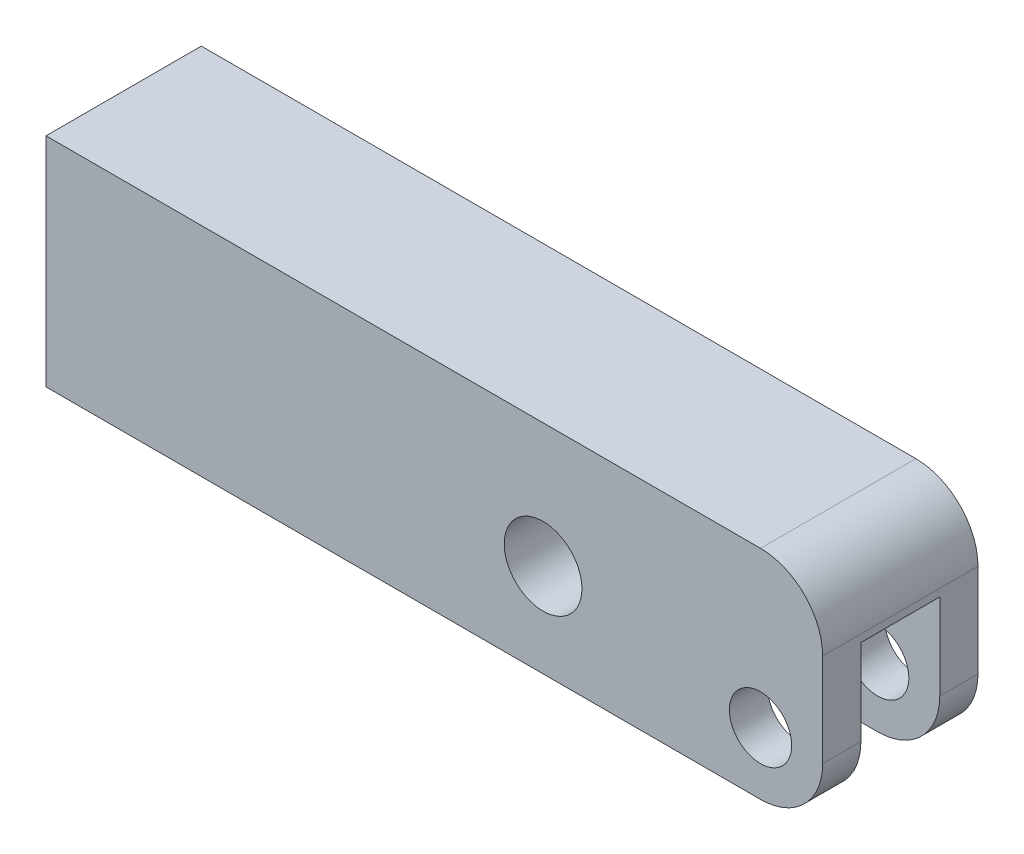
ISO-10303-21;
HEADER;
FILE_DESCRIPTION(('STEP AP214'),'2;1');
FILE_NAME('part.step','',(''),(''),'','','');
FILE_SCHEMA(('AUTOMOTIVE_DESIGN { 1 0 10303 214 1 1 1 1 }'));
ENDSEC;
DATA;
#1=APPLICATION_CONTEXT('core data for automotive mechanical design processes');
#2=APPLICATION_PROTOCOL_DEFINITION('international standard','automotive_design',2000,#1);
#3=PRODUCT_CONTEXT('',#1,'mechanical');
#4=PRODUCT('Part','Part','',(#3));
#5=PRODUCT_RELATED_PRODUCT_CATEGORY('part','',(#4));
#6=PRODUCT_DEFINITION_FORMATION('','',#4);
#7=PRODUCT_DEFINITION_CONTEXT('part definition',#1,'design');
#8=PRODUCT_DEFINITION('design','',#6,#7);
#9=PRODUCT_DEFINITION_SHAPE('','',#8);
#10=(LENGTH_UNIT() NAMED_UNIT(*) SI_UNIT(.MILLI.,.METRE.));
#11=(NAMED_UNIT(*) PLANE_ANGLE_UNIT() SI_UNIT($,.RADIAN.));
#12=(NAMED_UNIT(*) SI_UNIT($,.STERADIAN.) SOLID_ANGLE_UNIT());
#13=UNCERTAINTY_MEASURE_WITH_UNIT(LENGTH_MEASURE(1.E-05),#10,'distance_accuracy_value','');
#14=(GEOMETRIC_REPRESENTATION_CONTEXT(3) GLOBAL_UNCERTAINTY_ASSIGNED_CONTEXT((#13)) GLOBAL_UNIT_ASSIGNED_CONTEXT((#10,
#11,#12)) REPRESENTATION_CONTEXT('',''));
#15=CARTESIAN_POINT('',(0.,0.,0.));
#16=DIRECTION('',(0.,0.,1.));
#17=DIRECTION('',(1.,0.,0.));
#18=AXIS2_PLACEMENT_3D('',#15,#16,#17);
#19=CARTESIAN_POINT('',(0.,0.,15.875));
#20=DIRECTION('',(0.,0.,-1.));
#21=DIRECTION('',(-1.,0.,0.));
#22=AXIS2_PLACEMENT_3D('',#19,#20,#21);
#23=CYLINDRICAL_SURFACE('',#22,6.36905);
#24=CARTESIAN_POINT('',(0.,0.,8.0645));
#25=DIRECTION('',(0.,0.,1.));
#26=DIRECTION('',(1.,0.,0.));
#27=AXIS2_PLACEMENT_3D('',#24,#25,#26);
#28=CIRCLE('',#27,6.36905);
#29=CARTESIAN_POINT('',(6.36905,0.,8.0645));
#30=VERTEX_POINT('',#29);
#31=EDGE_CURVE('E164',#30,#30,#28,.T.);
#32=ORIENTED_EDGE('',*,*,#31,.F.);
#33=EDGE_LOOP('',(#32));
#34=FACE_BOUND('',#33,.T.);
#35=CARTESIAN_POINT('',(0.,0.,15.875));
#36=DIRECTION('',(0.,0.,1.));
#37=DIRECTION('',(1.,0.,0.));
#38=AXIS2_PLACEMENT_3D('',#35,#36,#37);
#39=CIRCLE('',#38,6.36905);
#40=CARTESIAN_POINT('',(6.36905,0.,15.875));
#41=VERTEX_POINT('',#40);
#42=EDGE_CURVE('E165',#41,#41,#39,.T.);
#43=ORIENTED_EDGE('',*,*,#42,.T.);
#44=EDGE_LOOP('',(#43));
#45=FACE_BOUND('',#44,.T.);
#46=ADVANCED_FACE('F36',(#34,#45),#23,.F.);
#47=CARTESIAN_POINT('',(-146.05,-12.7,15.875));
#48=DIRECTION('',(0.,0.,1.));
#49=DIRECTION('',(1.,0.,0.));
#50=AXIS2_PLACEMENT_3D('',#47,#48,#49);
#51=PLANE('',#50);
#52=ORIENTED_EDGE('',*,*,#42,.F.);
#53=EDGE_LOOP('',(#52));
#54=FACE_BOUND('',#53,.T.);
#55=DIRECTION('',(0.,1.,0.));
#56=VECTOR('',#55,1.);
#57=CARTESIAN_POINT('',(12.7,31.75,15.875));
#58=LINE('',#57,#56);
#59=CARTESIAN_POINT('',(12.7,0.,15.875));
#60=VERTEX_POINT('',#59);
#61=CARTESIAN_POINT('',(12.7,19.05,15.875));
#62=VERTEX_POINT('',#61);
#63=EDGE_CURVE('E178',#60,#62,#58,.T.);
#64=ORIENTED_EDGE('',*,*,#63,.T.);
#65=CARTESIAN_POINT('',(0.,19.05,15.875));
#66=DIRECTION('',(0.,0.,1.));
#67=DIRECTION('',(1.,0.,0.));
#68=AXIS2_PLACEMENT_3D('',#65,#66,#67);
#69=CIRCLE('',#68,12.7);
#70=CARTESIAN_POINT('',(0.,31.75,15.875));
#71=VERTEX_POINT('',#70);
#72=EDGE_CURVE('E218',#62,#71,#69,.T.);
#73=ORIENTED_EDGE('',*,*,#72,.T.);
#74=DIRECTION('',(-1.,0.,0.));
#75=VECTOR('',#74,1.);
#76=CARTESIAN_POINT('',(-146.05,31.75,15.875));
#77=LINE('',#76,#75);
#78=CARTESIAN_POINT('',(-146.05,31.75,15.875));
#79=VERTEX_POINT('',#78);
#80=EDGE_CURVE('E181',#71,#79,#77,.T.);
#81=ORIENTED_EDGE('',*,*,#80,.T.);
#82=DIRECTION('',(0.,-1.,0.));
#83=VECTOR('',#82,1.);
#84=CARTESIAN_POINT('',(-146.05,31.75,15.875));
#85=LINE('',#84,#83);
#86=CARTESIAN_POINT('',(-146.05,-12.7,15.875));
#87=VERTEX_POINT('',#86);
#88=EDGE_CURVE('E171',#79,#87,#85,.T.);
#89=ORIENTED_EDGE('',*,*,#88,.T.);
#90=DIRECTION('',(1.,0.,0.));
#91=VECTOR('',#90,1.);
#92=CARTESIAN_POINT('',(-146.05,-12.7,15.875));
#93=LINE('',#92,#91);
#94=CARTESIAN_POINT('',(0.,-12.7,15.875));
#95=VERTEX_POINT('',#94);
#96=EDGE_CURVE('E174',#87,#95,#93,.T.);
#97=ORIENTED_EDGE('',*,*,#96,.T.);
#98=CARTESIAN_POINT('',(0.,0.,15.875));
#99=DIRECTION('',(0.,0.,1.));
#100=DIRECTION('',(1.,0.,0.));
#101=AXIS2_PLACEMENT_3D('',#98,#99,#100);
#102=CIRCLE('',#101,12.7);
#103=EDGE_CURVE('E216',#95,#60,#102,.T.);
#104=ORIENTED_EDGE('',*,*,#103,.T.);
#105=EDGE_LOOP('',(#64,#73,#81,#89,#97,#104));
#106=FACE_BOUND('',#105,.T.);
#107=CARTESIAN_POINT('',(-44.45,6.35,15.875));
#108=DIRECTION('',(0.,0.,1.));
#109=DIRECTION('',(1.,0.,0.));
#110=AXIS2_PLACEMENT_3D('',#107,#108,#109);
#111=CIRCLE('',#110,7.94384999999999);
#112=CARTESIAN_POINT('',(-36.50615,6.35,15.875));
#113=VERTEX_POINT('',#112);
#114=EDGE_CURVE('E157',#113,#113,#111,.T.);
#115=ORIENTED_EDGE('',*,*,#114,.F.);
#116=EDGE_LOOP('',(#115));
#117=FACE_BOUND('',#116,.T.);
#118=ADVANCED_FACE('F252',(#54,#106,#117),#51,.T.);
#119=CARTESIAN_POINT('',(-146.05,-12.7,-15.875));
#120=DIRECTION('',(0.,0.,1.));
#121=DIRECTION('',(1.,0.,0.));
#122=AXIS2_PLACEMENT_3D('',#119,#120,#121);
#123=PLANE('',#122);
#124=CARTESIAN_POINT('',(0.,0.,-15.875));
#125=DIRECTION('',(0.,0.,1.));
#126=DIRECTION('',(1.,0.,0.));
#127=AXIS2_PLACEMENT_3D('',#124,#125,#126);
#128=CIRCLE('',#127,6.36905);
#129=CARTESIAN_POINT('',(6.36905,0.,-15.875));
#130=VERTEX_POINT('',#129);
#131=EDGE_CURVE('E160',#130,#130,#128,.T.);
#132=ORIENTED_EDGE('',*,*,#131,.T.);
#133=EDGE_LOOP('',(#132));
#134=FACE_BOUND('',#133,.T.);
#135=DIRECTION('',(-1.,0.,0.));
#136=VECTOR('',#135,1.);
#137=CARTESIAN_POINT('',(-146.05,31.75,-15.875));
#138=LINE('',#137,#136);
#139=CARTESIAN_POINT('',(0.,31.75,-15.875));
#140=VERTEX_POINT('',#139);
#141=CARTESIAN_POINT('',(-146.05,31.75,-15.875));
#142=VERTEX_POINT('',#141);
#143=EDGE_CURVE('E175',#140,#142,#138,.T.);
#144=ORIENTED_EDGE('',*,*,#143,.F.);
#145=CARTESIAN_POINT('',(0.,19.05,-15.875));
#146=DIRECTION('',(0.,0.,1.));
#147=DIRECTION('',(1.,0.,0.));
#148=AXIS2_PLACEMENT_3D('',#145,#146,#147);
#149=CIRCLE('',#148,12.7);
#150=CARTESIAN_POINT('',(12.7,19.05,-15.875));
#151=VERTEX_POINT('',#150);
#152=EDGE_CURVE('E206',#140,#151,#149,.F.);
#153=ORIENTED_EDGE('',*,*,#152,.T.);
#154=DIRECTION('',(0.,1.,0.));
#155=VECTOR('',#154,1.);
#156=CARTESIAN_POINT('',(12.7,31.75,-15.875));
#157=LINE('',#156,#155);
#158=CARTESIAN_POINT('',(12.7,0.,-15.875));
#159=VERTEX_POINT('',#158);
#160=EDGE_CURVE('E188',#159,#151,#157,.T.);
#161=ORIENTED_EDGE('',*,*,#160,.F.);
#162=CARTESIAN_POINT('',(0.,0.,-15.875));
#163=DIRECTION('',(0.,0.,1.));
#164=DIRECTION('',(1.,0.,0.));
#165=AXIS2_PLACEMENT_3D('',#162,#163,#164);
#166=CIRCLE('',#165,12.7);
#167=CARTESIAN_POINT('',(0.,-12.7,-15.875));
#168=VERTEX_POINT('',#167);
#169=EDGE_CURVE('E204',#159,#168,#166,.F.);
#170=ORIENTED_EDGE('',*,*,#169,.T.);
#171=DIRECTION('',(1.,0.,0.));
#172=VECTOR('',#171,1.);
#173=CARTESIAN_POINT('',(-146.05,-12.7,-15.875));
#174=LINE('',#173,#172);
#175=CARTESIAN_POINT('',(-146.05,-12.7,-15.875));
#176=VERTEX_POINT('',#175);
#177=EDGE_CURVE('E186',#176,#168,#174,.T.);
#178=ORIENTED_EDGE('',*,*,#177,.F.);
#179=DIRECTION('',(0.,-1.,0.));
#180=VECTOR('',#179,1.);
#181=CARTESIAN_POINT('',(-146.05,31.75,-15.875));
#182=LINE('',#181,#180);
#183=EDGE_CURVE('E168',#142,#176,#182,.T.);
#184=ORIENTED_EDGE('',*,*,#183,.F.);
#185=EDGE_LOOP('',(#144,#153,#161,#170,#178,#184));
#186=FACE_BOUND('',#185,.T.);
#187=CARTESIAN_POINT('',(-44.45,6.35,-15.875));
#188=DIRECTION('',(0.,0.,1.));
#189=DIRECTION('',(1.,0.,0.));
#190=AXIS2_PLACEMENT_3D('',#187,#188,#189);
#191=CIRCLE('',#190,7.94384999999999);
#192=CARTESIAN_POINT('',(-36.50615,6.35,-15.875));
#193=VERTEX_POINT('',#192);
#194=EDGE_CURVE('E161',#193,#193,#191,.T.);
#195=ORIENTED_EDGE('',*,*,#194,.T.);
#196=EDGE_LOOP('',(#195));
#197=FACE_BOUND('',#196,.T.);
#198=ADVANCED_FACE('F232',(#134,#186,#197),#123,.F.);
#199=CARTESIAN_POINT('',(-146.05,31.75,15.875));
#200=DIRECTION('',(1.,0.,0.));
#201=DIRECTION('',(0.,0.,-1.));
#202=AXIS2_PLACEMENT_3D('',#199,#200,#201);
#203=PLANE('',#202);
#204=ORIENTED_EDGE('',*,*,#183,.T.);
#205=DIRECTION('',(0.,0.,-1.));
#206=VECTOR('',#205,1.);
#207=CARTESIAN_POINT('',(-146.05,-12.7,15.875));
#208=LINE('',#207,#206);
#209=EDGE_CURVE('E194',#87,#176,#208,.T.);
#210=ORIENTED_EDGE('',*,*,#209,.F.);
#211=ORIENTED_EDGE('',*,*,#88,.F.);
#212=DIRECTION('',(0.,0.,-1.));
#213=VECTOR('',#212,1.);
#214=CARTESIAN_POINT('',(-146.05,31.75,15.875));
#215=LINE('',#214,#213);
#216=EDGE_CURVE('E183',#79,#142,#215,.T.);
#217=ORIENTED_EDGE('',*,*,#216,.T.);
#218=EDGE_LOOP('',(#204,#210,#211,#217));
#219=FACE_BOUND('',#218,.T.);
#220=ADVANCED_FACE('F239',(#219),#203,.F.);
#221=CARTESIAN_POINT('',(-146.05,-12.7,15.875));
#222=DIRECTION('',(0.,1.,0.));
#223=DIRECTION('',(0.,0.,1.));
#224=AXIS2_PLACEMENT_3D('',#221,#222,#223);
#225=PLANE('',#224);
#226=ORIENTED_EDGE('',*,*,#177,.T.);
#227=DIRECTION('',(0.,0.,-1.));
#228=VECTOR('',#227,1.);
#229=CARTESIAN_POINT('',(0.,-12.7,15.875));
#230=LINE('',#229,#228);
#231=CARTESIAN_POINT('',(0.,-12.7,-8.0645));
#232=VERTEX_POINT('',#231);
#233=EDGE_CURVE('E51',#168,#232,#230,.F.);
#234=ORIENTED_EDGE('',*,*,#233,.T.);
#235=DIRECTION('',(1.,0.,0.));
#236=VECTOR('',#235,1.);
#237=CARTESIAN_POINT('',(-17.526,-12.7,-8.0645));
#238=LINE('',#237,#236);
#239=CARTESIAN_POINT('',(-17.526,-12.7,-8.0645));
#240=VERTEX_POINT('',#239);
#241=EDGE_CURVE('E144',#240,#232,#238,.T.);
#242=ORIENTED_EDGE('',*,*,#241,.F.);
#243=CARTESIAN_POINT('',(-17.526,-12.7,0.));
#244=DIRECTION('',(0.,-1.,0.));
#245=DIRECTION('',(0.,0.,-1.));
#246=AXIS2_PLACEMENT_3D('',#243,#244,#245);
#247=CIRCLE('',#246,8.0645);
#248=CARTESIAN_POINT('',(-17.526,-12.7,8.0645));
#249=VERTEX_POINT('',#248);
#250=EDGE_CURVE('E127',#249,#240,#247,.T.);
#251=ORIENTED_EDGE('',*,*,#250,.F.);
#252=DIRECTION('',(-1.,0.,0.));
#253=VECTOR('',#252,1.);
#254=CARTESIAN_POINT('',(-17.526,-12.7,8.0645));
#255=LINE('',#254,#253);
#256=CARTESIAN_POINT('',(0.,-12.7,8.0645));
#257=VERTEX_POINT('',#256);
#258=EDGE_CURVE('E142',#257,#249,#255,.T.);
#259=ORIENTED_EDGE('',*,*,#258,.F.);
#260=DIRECTION('',(0.,0.,-1.));
#261=VECTOR('',#260,1.);
#262=CARTESIAN_POINT('',(0.,-12.7,15.875));
#263=LINE('',#262,#261);
#264=EDGE_CURVE('E220',#257,#95,#263,.F.);
#265=ORIENTED_EDGE('',*,*,#264,.T.);
#266=ORIENTED_EDGE('',*,*,#96,.F.);
#267=ORIENTED_EDGE('',*,*,#209,.T.);
#268=EDGE_LOOP('',(#226,#234,#242,#251,#259,#265,#266,#267));
#269=FACE_BOUND('',#268,.T.);
#270=ADVANCED_FACE('F235',(#269),#225,.F.);
#271=CARTESIAN_POINT('',(12.7,31.75,15.875));
#272=DIRECTION('',(-1.,0.,0.));
#273=DIRECTION('',(0.,-1.,0.));
#274=AXIS2_PLACEMENT_3D('',#271,#272,#273);
#275=PLANE('',#274);
#276=ORIENTED_EDGE('',*,*,#160,.T.);
#277=DIRECTION('',(0.,0.,-1.));
#278=VECTOR('',#277,1.);
#279=CARTESIAN_POINT('',(12.7,19.05,15.875));
#280=LINE('',#279,#278);
#281=EDGE_CURVE('E214',#151,#62,#280,.F.);
#282=ORIENTED_EDGE('',*,*,#281,.T.);
#283=ORIENTED_EDGE('',*,*,#63,.F.);
#284=DIRECTION('',(0.,0.,-1.));
#285=VECTOR('',#284,1.);
#286=CARTESIAN_POINT('',(12.7,0.,15.875));
#287=LINE('',#286,#285);
#288=CARTESIAN_POINT('',(12.7,0.,8.0645));
#289=VERTEX_POINT('',#288);
#290=EDGE_CURVE('E208',#60,#289,#287,.T.);
#291=ORIENTED_EDGE('',*,*,#290,.T.);
#292=DIRECTION('',(0.,-1.,0.));
#293=VECTOR('',#292,1.);
#294=CARTESIAN_POINT('',(12.7,17.526,8.0645));
#295=LINE('',#294,#293);
#296=CARTESIAN_POINT('',(12.7,17.526,8.0645));
#297=VERTEX_POINT('',#296);
#298=EDGE_CURVE('E154',#297,#289,#295,.T.);
#299=ORIENTED_EDGE('',*,*,#298,.F.);
#300=DIRECTION('',(0.,0.,1.));
#301=VECTOR('',#300,1.);
#302=CARTESIAN_POINT('',(12.7,17.526,8.0645));
#303=LINE('',#302,#301);
#304=CARTESIAN_POINT('',(12.7,17.526,-8.0645));
#305=VERTEX_POINT('',#304);
#306=EDGE_CURVE('E138',#305,#297,#303,.T.);
#307=ORIENTED_EDGE('',*,*,#306,.F.);
#308=DIRECTION('',(0.,-1.,0.));
#309=VECTOR('',#308,1.);
#310=CARTESIAN_POINT('',(12.7,17.526,-8.0645));
#311=LINE('',#310,#309);
#312=CARTESIAN_POINT('',(12.7,0.,-8.0645));
#313=VERTEX_POINT('',#312);
#314=EDGE_CURVE('E129',#305,#313,#311,.T.);
#315=ORIENTED_EDGE('',*,*,#314,.T.);
#316=DIRECTION('',(0.,0.,-1.));
#317=VECTOR('',#316,1.);
#318=CARTESIAN_POINT('',(12.7,0.,15.875));
#319=LINE('',#318,#317);
#320=EDGE_CURVE('E211',#313,#159,#319,.T.);
#321=ORIENTED_EDGE('',*,*,#320,.T.);
#322=EDGE_LOOP('',(#276,#282,#283,#291,#299,#307,#315,#321));
#323=FACE_BOUND('',#322,.T.);
#324=ADVANCED_FACE('F226',(#323),#275,.F.);
#325=CARTESIAN_POINT('',(-146.05,31.75,15.875));
#326=DIRECTION('',(0.,-1.,0.));
#327=DIRECTION('',(0.,0.,-1.));
#328=AXIS2_PLACEMENT_3D('',#325,#326,#327);
#329=PLANE('',#328);
#330=ORIENTED_EDGE('',*,*,#80,.F.);
#331=DIRECTION('',(0.,0.,-1.));
#332=VECTOR('',#331,1.);
#333=CARTESIAN_POINT('',(0.,31.75,15.875));
#334=LINE('',#333,#332);
#335=EDGE_CURVE('E197',#71,#140,#334,.T.);
#336=ORIENTED_EDGE('',*,*,#335,.T.);
#337=ORIENTED_EDGE('',*,*,#143,.T.);
#338=ORIENTED_EDGE('',*,*,#216,.F.);
#339=EDGE_LOOP('',(#330,#336,#337,#338));
#340=FACE_BOUND('',#339,.T.);
#341=ADVANCED_FACE('F243',(#340),#329,.F.);
#342=CARTESIAN_POINT('',(0.,0.,-8.0645));
#343=DIRECTION('',(0.,0.,-1.));
#344=DIRECTION('',(-1.,0.,0.));
#345=AXIS2_PLACEMENT_3D('',#342,#343,#344);
#346=CIRCLE('',#345,6.36905);
#347=CARTESIAN_POINT('',(-6.36905,0.,-8.0645));
#348=VERTEX_POINT('',#347);
#349=EDGE_CURVE('E153',#348,#348,#346,.T.);
#350=ORIENTED_EDGE('',*,*,#349,.F.);
#351=EDGE_LOOP('',(#350));
#352=FACE_BOUND('',#351,.T.);
#353=ORIENTED_EDGE('',*,*,#131,.F.);
#354=EDGE_LOOP('',(#353));
#355=FACE_BOUND('',#354,.T.);
#356=ADVANCED_FACE('F273',(#352,#355),#23,.F.);
#357=CARTESIAN_POINT('',(-44.45,6.35,15.875));
#358=DIRECTION('',(0.,0.,-1.));
#359=DIRECTION('',(-1.,0.,0.));
#360=AXIS2_PLACEMENT_3D('',#357,#358,#359);
#361=CYLINDRICAL_SURFACE('',#360,7.94384999999999);
#362=ORIENTED_EDGE('',*,*,#114,.T.);
#363=EDGE_LOOP('',(#362));
#364=FACE_BOUND('',#363,.T.);
#365=ORIENTED_EDGE('',*,*,#194,.F.);
#366=EDGE_LOOP('',(#365));
#367=FACE_BOUND('',#366,.T.);
#368=ADVANCED_FACE('F267',(#364,#367),#361,.F.);
#369=CARTESIAN_POINT('',(-17.526,17.526,0.));
#370=DIRECTION('',(0.,-1.,0.));
#371=DIRECTION('',(0.,0.,-1.));
#372=AXIS2_PLACEMENT_3D('',#369,#370,#371);
#373=CYLINDRICAL_SURFACE('',#372,8.0645);
#374=ORIENTED_EDGE('',*,*,#250,.T.);
#375=DIRECTION('',(0.,-1.,0.));
#376=VECTOR('',#375,1.);
#377=CARTESIAN_POINT('',(-17.526,17.526,-8.0645));
#378=LINE('',#377,#376);
#379=CARTESIAN_POINT('',(-17.526,17.526,-8.0645));
#380=VERTEX_POINT('',#379);
#381=EDGE_CURVE('E119',#380,#240,#378,.T.);
#382=ORIENTED_EDGE('',*,*,#381,.F.);
#383=CARTESIAN_POINT('',(-17.526,17.526,0.));
#384=DIRECTION('',(0.,-1.,0.));
#385=DIRECTION('',(0.,0.,-1.));
#386=AXIS2_PLACEMENT_3D('',#383,#384,#385);
#387=CIRCLE('',#386,8.0645);
#388=CARTESIAN_POINT('',(-17.526,17.526,8.0645));
#389=VERTEX_POINT('',#388);
#390=EDGE_CURVE('E124',#389,#380,#387,.T.);
#391=ORIENTED_EDGE('',*,*,#390,.F.);
#392=DIRECTION('',(0.,-1.,0.));
#393=VECTOR('',#392,1.);
#394=CARTESIAN_POINT('',(-17.526,17.526,8.0645));
#395=LINE('',#394,#393);
#396=EDGE_CURVE('E151',#389,#249,#395,.T.);
#397=ORIENTED_EDGE('',*,*,#396,.T.);
#398=EDGE_LOOP('',(#374,#382,#391,#397));
#399=FACE_BOUND('',#398,.T.);
#400=ADVANCED_FACE('F121',(#399),#373,.F.);
#401=CARTESIAN_POINT('',(-17.526,17.526,8.0645));
#402=DIRECTION('',(0.,0.,1.));
#403=DIRECTION('',(1.,0.,0.));
#404=AXIS2_PLACEMENT_3D('',#401,#402,#403);
#405=PLANE('',#404);
#406=ORIENTED_EDGE('',*,*,#31,.T.);
#407=EDGE_LOOP('',(#406));
#408=FACE_BOUND('',#407,.T.);
#409=ORIENTED_EDGE('',*,*,#298,.T.);
#410=CARTESIAN_POINT('',(0.,0.,8.0645));
#411=DIRECTION('',(0.,0.,1.));
#412=DIRECTION('',(1.,0.,0.));
#413=AXIS2_PLACEMENT_3D('',#410,#411,#412);
#414=CIRCLE('',#413,12.7);
#415=EDGE_CURVE('E11',#289,#257,#414,.F.);
#416=ORIENTED_EDGE('',*,*,#415,.T.);
#417=ORIENTED_EDGE('',*,*,#258,.T.);
#418=ORIENTED_EDGE('',*,*,#396,.F.);
#419=DIRECTION('',(-1.,0.,0.));
#420=VECTOR('',#419,1.);
#421=CARTESIAN_POINT('',(-17.526,17.526,8.0645));
#422=LINE('',#421,#420);
#423=EDGE_CURVE('E130',#297,#389,#422,.T.);
#424=ORIENTED_EDGE('',*,*,#423,.F.);
#425=EDGE_LOOP('',(#409,#416,#417,#418,#424));
#426=FACE_BOUND('',#425,.T.);
#427=ADVANCED_FACE('F257',(#408,#426),#405,.F.);
#428=CARTESIAN_POINT('',(-17.526,17.526,-8.0645));
#429=DIRECTION('',(0.,0.,-1.));
#430=DIRECTION('',(-1.,0.,0.));
#431=AXIS2_PLACEMENT_3D('',#428,#429,#430);
#432=PLANE('',#431);
#433=ORIENTED_EDGE('',*,*,#349,.T.);
#434=EDGE_LOOP('',(#433));
#435=FACE_BOUND('',#434,.T.);
#436=ORIENTED_EDGE('',*,*,#241,.T.);
#437=CARTESIAN_POINT('',(0.,0.,-8.0645));
#438=DIRECTION('',(0.,0.,-1.));
#439=DIRECTION('',(-1.,0.,0.));
#440=AXIS2_PLACEMENT_3D('',#437,#438,#439);
#441=CIRCLE('',#440,12.7);
#442=EDGE_CURVE('E44',#232,#313,#441,.F.);
#443=ORIENTED_EDGE('',*,*,#442,.T.);
#444=ORIENTED_EDGE('',*,*,#314,.F.);
#445=DIRECTION('',(1.,0.,0.));
#446=VECTOR('',#445,1.);
#447=CARTESIAN_POINT('',(-17.526,17.526,-8.0645));
#448=LINE('',#447,#446);
#449=EDGE_CURVE('E133',#380,#305,#448,.T.);
#450=ORIENTED_EDGE('',*,*,#449,.F.);
#451=ORIENTED_EDGE('',*,*,#381,.T.);
#452=EDGE_LOOP('',(#436,#443,#444,#450,#451));
#453=FACE_BOUND('',#452,.T.);
#454=ADVANCED_FACE('F134',(#435,#453),#432,.F.);
#455=CARTESIAN_POINT('',(-17.526,17.526,0.));
#456=DIRECTION('',(0.,-1.,0.));
#457=DIRECTION('',(0.,0.,-1.));
#458=AXIS2_PLACEMENT_3D('',#455,#456,#457);
#459=PLANE('',#458);
#460=ORIENTED_EDGE('',*,*,#390,.T.);
#461=ORIENTED_EDGE('',*,*,#449,.T.);
#462=ORIENTED_EDGE('',*,*,#306,.T.);
#463=ORIENTED_EDGE('',*,*,#423,.T.);
#464=EDGE_LOOP('',(#460,#461,#462,#463));
#465=FACE_BOUND('',#464,.T.);
#466=ADVANCED_FACE('F140',(#465),#459,.T.);
#467=CARTESIAN_POINT('',(0.,19.05,15.875));
#468=DIRECTION('',(0.,0.,-1.));
#469=DIRECTION('',(-1.,0.,0.));
#470=AXIS2_PLACEMENT_3D('',#467,#468,#469);
#471=CYLINDRICAL_SURFACE('',#470,12.7);
#472=ORIENTED_EDGE('',*,*,#72,.F.);
#473=ORIENTED_EDGE('',*,*,#281,.F.);
#474=ORIENTED_EDGE('',*,*,#152,.F.);
#475=ORIENTED_EDGE('',*,*,#335,.F.);
#476=EDGE_LOOP('',(#472,#473,#474,#475));
#477=FACE_BOUND('',#476,.T.);
#478=ADVANCED_FACE('F247',(#477),#471,.T.);
#479=CARTESIAN_POINT('',(0.,0.,15.875));
#480=DIRECTION('',(0.,0.,-1.));
#481=DIRECTION('',(-1.,0.,0.));
#482=AXIS2_PLACEMENT_3D('',#479,#480,#481);
#483=CYLINDRICAL_SURFACE('',#482,12.7);
#484=ORIENTED_EDGE('',*,*,#442,.F.);
#485=ORIENTED_EDGE('',*,*,#233,.F.);
#486=ORIENTED_EDGE('',*,*,#169,.F.);
#487=ORIENTED_EDGE('',*,*,#320,.F.);
#488=EDGE_LOOP('',(#484,#485,#486,#487));
#489=FACE_BOUND('',#488,.T.);
#490=ADVANCED_FACE('F229',(#489),#483,.T.);
#491=CARTESIAN_POINT('',(0.,0.,15.875));
#492=DIRECTION('',(0.,0.,-1.));
#493=DIRECTION('',(-1.,0.,0.));
#494=AXIS2_PLACEMENT_3D('',#491,#492,#493);
#495=CYLINDRICAL_SURFACE('',#494,12.7);
#496=ORIENTED_EDGE('',*,*,#103,.F.);
#497=ORIENTED_EDGE('',*,*,#264,.F.);
#498=ORIENTED_EDGE('',*,*,#415,.F.);
#499=ORIENTED_EDGE('',*,*,#290,.F.);
#500=EDGE_LOOP('',(#496,#497,#498,#499));
#501=FACE_BOUND('',#500,.T.);
#502=ADVANCED_FACE('F38',(#501),#495,.T.);
#503=CLOSED_SHELL('',(#46,#118,#198,#220,#270,#324,#341,#356,#368,#400,#427,#454,#466,#478,#490,#502));
#504=MANIFOLD_SOLID_BREP('B2',#503);
#505=ADVANCED_BREP_SHAPE_REPRESENTATION('',(#18,#504),#14);
#506=SHAPE_DEFINITION_REPRESENTATION(#9,#505);
ENDSEC;
END-ISO-10303-21;
